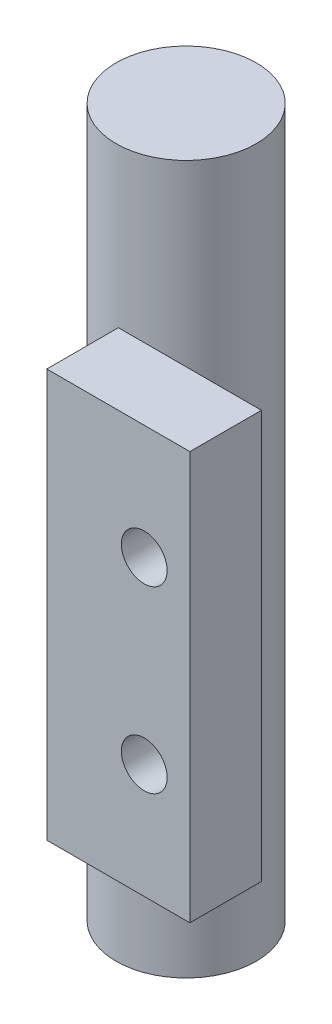
ISO-10303-21;
HEADER;
FILE_DESCRIPTION(('STEP AP214'),'2;1');
FILE_NAME('part.step','',(''),(''),'','','');
FILE_SCHEMA(('AUTOMOTIVE_DESIGN { 1 0 10303 214 1 1 1 1 }'));
ENDSEC;
DATA;
#1=APPLICATION_CONTEXT('core data for automotive mechanical design processes');
#2=APPLICATION_PROTOCOL_DEFINITION('international standard','automotive_design',2000,#1);
#3=PRODUCT_CONTEXT('',#1,'mechanical');
#4=PRODUCT('Part','Part','',(#3));
#5=PRODUCT_RELATED_PRODUCT_CATEGORY('part','',(#4));
#6=PRODUCT_DEFINITION_FORMATION('','',#4);
#7=PRODUCT_DEFINITION_CONTEXT('part definition',#1,'design');
#8=PRODUCT_DEFINITION('design','',#6,#7);
#9=PRODUCT_DEFINITION_SHAPE('','',#8);
#10=(LENGTH_UNIT() NAMED_UNIT(*) SI_UNIT(.MILLI.,.METRE.));
#11=(NAMED_UNIT(*) PLANE_ANGLE_UNIT() SI_UNIT($,.RADIAN.));
#12=(NAMED_UNIT(*) SI_UNIT($,.STERADIAN.) SOLID_ANGLE_UNIT());
#13=UNCERTAINTY_MEASURE_WITH_UNIT(LENGTH_MEASURE(1.E-05),#10,'distance_accuracy_value','');
#14=(GEOMETRIC_REPRESENTATION_CONTEXT(3) GLOBAL_UNCERTAINTY_ASSIGNED_CONTEXT((#13)) GLOBAL_UNIT_ASSIGNED_CONTEXT((#10,
#11,#12)) REPRESENTATION_CONTEXT('',''));
#15=CARTESIAN_POINT('',(0.,0.,0.));
#16=DIRECTION('',(0.,0.,1.));
#17=DIRECTION('',(1.,0.,0.));
#18=AXIS2_PLACEMENT_3D('',#15,#16,#17);
#19=CARTESIAN_POINT('',(-1.21410888509384,8.53481015756942,-5.9555332189598));
#20=DIRECTION('',(0.,-1.,0.));
#21=DIRECTION('',(1.,0.,0.));
#22=AXIS2_PLACEMENT_3D('',#19,#20,#21);
#23=CYLINDRICAL_SURFACE('',#22,4.9);
#24=CARTESIAN_POINT('',(-1.21410888509384,8.53481015756942,-5.9555332189598));
#25=DIRECTION('',(0.,-1.,0.));
#26=DIRECTION('',(1.,0.,0.));
#27=AXIS2_PLACEMENT_3D('',#24,#25,#26);
#28=CIRCLE('',#27,4.9);
#29=CARTESIAN_POINT('',(3.68589111490616,8.53481015756942,-5.9555332189598));
#30=VERTEX_POINT('',#29);
#31=EDGE_CURVE('E11',#30,#30,#28,.T.);
#32=ORIENTED_EDGE('',*,*,#31,.T.);
#33=EDGE_LOOP('',(#32));
#34=FACE_BOUND('',#33,.T.);
#35=CARTESIAN_POINT('',(-1.21410888509382,-40.9651898424306,-5.95553321895981));
#36=DIRECTION('',(0.,-1.,0.));
#37=DIRECTION('',(1.,0.,0.));
#38=AXIS2_PLACEMENT_3D('',#35,#36,#37);
#39=CIRCLE('',#38,4.9);
#40=CARTESIAN_POINT('',(3.68589111490618,-40.9651898424306,-5.95553321895981));
#41=VERTEX_POINT('',#40);
#42=EDGE_CURVE('E46',#41,#41,#39,.T.);
#43=ORIENTED_EDGE('',*,*,#42,.F.);
#44=EDGE_LOOP('',(#43));
#45=FACE_BOUND('',#44,.T.);
#46=ADVANCED_FACE('F43',(#34,#45),#23,.T.);
#47=CARTESIAN_POINT('',(-1.21410888509384,8.53481015756942,-5.9555332189598));
#48=DIRECTION('',(0.,-1.,0.));
#49=DIRECTION('',(1.,0.,0.));
#50=AXIS2_PLACEMENT_3D('',#47,#48,#49);
#51=PLANE('',#50);
#52=ORIENTED_EDGE('',*,*,#31,.F.);
#53=EDGE_LOOP('',(#52));
#54=FACE_BOUND('',#53,.T.);
#55=ADVANCED_FACE('F58',(#54),#51,.F.);
#56=CARTESIAN_POINT('',(-1.21410888509382,-40.9651898424306,-5.95553321895981));
#57=DIRECTION('',(0.,-1.,0.));
#58=DIRECTION('',(1.,0.,0.));
#59=AXIS2_PLACEMENT_3D('',#56,#57,#58);
#60=PLANE('',#59);
#61=ORIENTED_EDGE('',*,*,#42,.T.);
#62=EDGE_LOOP('',(#61));
#63=FACE_BOUND('',#62,.T.);
#64=ADVANCED_FACE('F55',(#63),#60,.T.);
#65=CLOSED_SHELL('',(#46,#55,#64));
#66=MANIFOLD_SOLID_BREP('B2',#65);
#67=CARTESIAN_POINT('',(10.,-1.47000000000001,5.));
#68=DIRECTION('',(-1.,0.,0.));
#69=DIRECTION('',(0.,-1.,0.));
#70=AXIS2_PLACEMENT_3D('',#67,#68,#69);
#71=PLANE('',#70);
#72=DIRECTION('',(0.,1.,0.));
#73=VECTOR('',#72,1.);
#74=CARTESIAN_POINT('',(10.,-1.47000000000001,0.));
#75=LINE('',#74,#73);
#76=CARTESIAN_POINT('',(10.,-30.,0.));
#77=VERTEX_POINT('',#76);
#78=CARTESIAN_POINT('',(10.,-1.47000000000001,0.));
#79=VERTEX_POINT('',#78);
#80=EDGE_CURVE('E147',#77,#79,#75,.T.);
#81=ORIENTED_EDGE('',*,*,#80,.T.);
#82=DIRECTION('',(0.,0.,-1.));
#83=VECTOR('',#82,1.);
#84=CARTESIAN_POINT('',(10.,-1.47000000000001,5.));
#85=LINE('',#84,#83);
#86=CARTESIAN_POINT('',(10.,-1.47000000000001,5.));
#87=VERTEX_POINT('',#86);
#88=EDGE_CURVE('E41',#87,#79,#85,.T.);
#89=ORIENTED_EDGE('',*,*,#88,.F.);
#90=DIRECTION('',(0.,1.,0.));
#91=VECTOR('',#90,1.);
#92=CARTESIAN_POINT('',(10.,-1.47000000000001,5.));
#93=LINE('',#92,#91);
#94=CARTESIAN_POINT('',(10.,-30.,5.));
#95=VERTEX_POINT('',#94);
#96=EDGE_CURVE('E135',#95,#87,#93,.T.);
#97=ORIENTED_EDGE('',*,*,#96,.F.);
#98=DIRECTION('',(0.,0.,-1.));
#99=VECTOR('',#98,1.);
#100=CARTESIAN_POINT('',(10.,-30.,5.));
#101=LINE('',#100,#99);
#102=EDGE_CURVE('E143',#95,#77,#101,.T.);
#103=ORIENTED_EDGE('',*,*,#102,.T.);
#104=EDGE_LOOP('',(#81,#89,#97,#103));
#105=FACE_BOUND('',#104,.T.);
#106=ADVANCED_FACE('F84',(#105),#71,.F.);
#107=CARTESIAN_POINT('',(10.,-1.47000000000001,5.));
#108=DIRECTION('',(0.,-1.,0.));
#109=DIRECTION('',(1.,0.,0.));
#110=AXIS2_PLACEMENT_3D('',#107,#108,#109);
#111=PLANE('',#110);
#112=DIRECTION('',(-1.,0.,0.));
#113=VECTOR('',#112,1.);
#114=CARTESIAN_POINT('',(10.,-1.47000000000001,0.));
#115=LINE('',#114,#113);
#116=CARTESIAN_POINT('',(0.,-1.47000000000001,0.));
#117=VERTEX_POINT('',#116);
#118=EDGE_CURVE('E139',#79,#117,#115,.T.);
#119=ORIENTED_EDGE('',*,*,#118,.T.);
#120=DIRECTION('',(0.,0.,-1.));
#121=VECTOR('',#120,1.);
#122=CARTESIAN_POINT('',(0.,-1.47000000000001,5.));
#123=LINE('',#122,#121);
#124=CARTESIAN_POINT('',(0.,-1.47000000000001,5.));
#125=VERTEX_POINT('',#124);
#126=EDGE_CURVE('E92',#125,#117,#123,.T.);
#127=ORIENTED_EDGE('',*,*,#126,.F.);
#128=DIRECTION('',(-1.,0.,0.));
#129=VECTOR('',#128,1.);
#130=CARTESIAN_POINT('',(10.,-1.47000000000001,5.));
#131=LINE('',#130,#129);
#132=EDGE_CURVE('E130',#87,#125,#131,.T.);
#133=ORIENTED_EDGE('',*,*,#132,.F.);
#134=ORIENTED_EDGE('',*,*,#88,.T.);
#135=EDGE_LOOP('',(#119,#127,#133,#134));
#136=FACE_BOUND('',#135,.T.);
#137=ADVANCED_FACE('F138',(#136),#111,.F.);
#138=CARTESIAN_POINT('',(0.,-1.47000000000001,5.));
#139=DIRECTION('',(1.,0.,0.));
#140=DIRECTION('',(0.,1.,0.));
#141=AXIS2_PLACEMENT_3D('',#138,#139,#140);
#142=PLANE('',#141);
#143=DIRECTION('',(0.,-1.,0.));
#144=VECTOR('',#143,1.);
#145=CARTESIAN_POINT('',(0.,-1.47000000000001,0.));
#146=LINE('',#145,#144);
#147=CARTESIAN_POINT('',(0.,-30.,0.));
#148=VERTEX_POINT('',#147);
#149=EDGE_CURVE('E117',#117,#148,#146,.T.);
#150=ORIENTED_EDGE('',*,*,#149,.T.);
#151=DIRECTION('',(0.,0.,-1.));
#152=VECTOR('',#151,1.);
#153=CARTESIAN_POINT('',(0.,-30.,5.));
#154=LINE('',#153,#152);
#155=CARTESIAN_POINT('',(0.,-30.,5.));
#156=VERTEX_POINT('',#155);
#157=EDGE_CURVE('E140',#156,#148,#154,.T.);
#158=ORIENTED_EDGE('',*,*,#157,.F.);
#159=DIRECTION('',(0.,-1.,0.));
#160=VECTOR('',#159,1.);
#161=CARTESIAN_POINT('',(0.,-1.47000000000001,5.));
#162=LINE('',#161,#160);
#163=EDGE_CURVE('E133',#125,#156,#162,.T.);
#164=ORIENTED_EDGE('',*,*,#163,.F.);
#165=ORIENTED_EDGE('',*,*,#126,.T.);
#166=EDGE_LOOP('',(#150,#158,#164,#165));
#167=FACE_BOUND('',#166,.T.);
#168=ADVANCED_FACE('F141',(#167),#142,.F.);
#169=CARTESIAN_POINT('',(10.,-30.,5.));
#170=DIRECTION('',(0.,1.,0.));
#171=DIRECTION('',(-1.,0.,0.));
#172=AXIS2_PLACEMENT_3D('',#169,#170,#171);
#173=PLANE('',#172);
#174=DIRECTION('',(1.,0.,0.));
#175=VECTOR('',#174,1.);
#176=CARTESIAN_POINT('',(10.,-30.,0.));
#177=LINE('',#176,#175);
#178=EDGE_CURVE('E123',#148,#77,#177,.T.);
#179=ORIENTED_EDGE('',*,*,#178,.T.);
#180=ORIENTED_EDGE('',*,*,#102,.F.);
#181=DIRECTION('',(1.,0.,0.));
#182=VECTOR('',#181,1.);
#183=CARTESIAN_POINT('',(10.,-30.,5.));
#184=LINE('',#183,#182);
#185=EDGE_CURVE('E100',#156,#95,#184,.T.);
#186=ORIENTED_EDGE('',*,*,#185,.F.);
#187=ORIENTED_EDGE('',*,*,#157,.T.);
#188=EDGE_LOOP('',(#179,#180,#186,#187));
#189=FACE_BOUND('',#188,.T.);
#190=ADVANCED_FACE('F155',(#189),#173,.F.);
#191=CARTESIAN_POINT('',(0.,0.,5.));
#192=DIRECTION('',(0.,0.,-1.));
#193=DIRECTION('',(-1.,0.,0.));
#194=AXIS2_PLACEMENT_3D('',#191,#192,#193);
#195=PLANE('',#194);
#196=CARTESIAN_POINT('',(6.81031037360218,-9.47000000000007,5.));
#197=DIRECTION('',(0.,0.,-1.));
#198=DIRECTION('',(-1.,0.,0.));
#199=AXIS2_PLACEMENT_3D('',#196,#197,#198);
#200=CIRCLE('',#199,1.6);
#201=CARTESIAN_POINT('',(5.21031037360218,-9.47000000000007,5.));
#202=VERTEX_POINT('',#201);
#203=EDGE_CURVE('E150',#202,#202,#200,.T.);
#204=ORIENTED_EDGE('',*,*,#203,.T.);
#205=EDGE_LOOP('',(#204));
#206=FACE_BOUND('',#205,.T.);
#207=CARTESIAN_POINT('',(6.81031037360219,-22.0000000000001,5.));
#208=DIRECTION('',(0.,0.,-1.));
#209=DIRECTION('',(-1.,0.,0.));
#210=AXIS2_PLACEMENT_3D('',#207,#208,#209);
#211=CIRCLE('',#210,1.6);
#212=CARTESIAN_POINT('',(5.21031037360218,-22.0000000000001,5.));
#213=VERTEX_POINT('',#212);
#214=EDGE_CURVE('E163',#213,#213,#211,.T.);
#215=ORIENTED_EDGE('',*,*,#214,.T.);
#216=EDGE_LOOP('',(#215));
#217=FACE_BOUND('',#216,.T.);
#218=ORIENTED_EDGE('',*,*,#96,.T.);
#219=ORIENTED_EDGE('',*,*,#132,.T.);
#220=ORIENTED_EDGE('',*,*,#163,.T.);
#221=ORIENTED_EDGE('',*,*,#185,.T.);
#222=EDGE_LOOP('',(#218,#219,#220,#221));
#223=FACE_BOUND('',#222,.T.);
#224=ADVANCED_FACE('F131',(#206,#217,#223),#195,.F.);
#225=CARTESIAN_POINT('',(0.,0.,0.));
#226=DIRECTION('',(0.,0.,-1.));
#227=DIRECTION('',(-1.,0.,0.));
#228=AXIS2_PLACEMENT_3D('',#225,#226,#227);
#229=PLANE('',#228);
#230=CARTESIAN_POINT('',(6.81031037360218,-9.47000000000007,0.));
#231=DIRECTION('',(0.,0.,-1.));
#232=DIRECTION('',(-1.,0.,0.));
#233=AXIS2_PLACEMENT_3D('',#230,#231,#232);
#234=CIRCLE('',#233,1.6);
#235=CARTESIAN_POINT('',(5.21031037360218,-9.47000000000007,0.));
#236=VERTEX_POINT('',#235);
#237=EDGE_CURVE('E166',#236,#236,#234,.T.);
#238=ORIENTED_EDGE('',*,*,#237,.F.);
#239=EDGE_LOOP('',(#238));
#240=FACE_BOUND('',#239,.T.);
#241=CARTESIAN_POINT('',(6.81031037360219,-22.0000000000001,0.));
#242=DIRECTION('',(0.,0.,-1.));
#243=DIRECTION('',(-1.,0.,0.));
#244=AXIS2_PLACEMENT_3D('',#241,#242,#243);
#245=CIRCLE('',#244,1.6);
#246=CARTESIAN_POINT('',(5.21031037360218,-22.0000000000001,0.));
#247=VERTEX_POINT('',#246);
#248=EDGE_CURVE('E167',#247,#247,#245,.T.);
#249=ORIENTED_EDGE('',*,*,#248,.F.);
#250=EDGE_LOOP('',(#249));
#251=FACE_BOUND('',#250,.T.);
#252=ORIENTED_EDGE('',*,*,#80,.F.);
#253=ORIENTED_EDGE('',*,*,#178,.F.);
#254=ORIENTED_EDGE('',*,*,#149,.F.);
#255=ORIENTED_EDGE('',*,*,#118,.F.);
#256=EDGE_LOOP('',(#252,#253,#254,#255));
#257=FACE_BOUND('',#256,.T.);
#258=ADVANCED_FACE('F158',(#240,#251,#257),#229,.T.);
#259=CARTESIAN_POINT('',(6.81031037360219,-22.0000000000001,43.));
#260=DIRECTION('',(0.,0.,-1.));
#261=DIRECTION('',(-1.,0.,0.));
#262=AXIS2_PLACEMENT_3D('',#259,#260,#261);
#263=CYLINDRICAL_SURFACE('',#262,1.6);
#264=ORIENTED_EDGE('',*,*,#248,.T.);
#265=EDGE_LOOP('',(#264));
#266=FACE_BOUND('',#265,.T.);
#267=ORIENTED_EDGE('',*,*,#214,.F.);
#268=EDGE_LOOP('',(#267));
#269=FACE_BOUND('',#268,.T.);
#270=ADVANCED_FACE('F178',(#266,#269),#263,.F.);
#271=CARTESIAN_POINT('',(6.81031037360218,-9.47000000000007,43.));
#272=DIRECTION('',(0.,0.,-1.));
#273=DIRECTION('',(-1.,0.,0.));
#274=AXIS2_PLACEMENT_3D('',#271,#272,#273);
#275=CYLINDRICAL_SURFACE('',#274,1.6);
#276=ORIENTED_EDGE('',*,*,#237,.T.);
#277=EDGE_LOOP('',(#276));
#278=FACE_BOUND('',#277,.T.);
#279=ORIENTED_EDGE('',*,*,#203,.F.);
#280=EDGE_LOOP('',(#279));
#281=FACE_BOUND('',#280,.T.);
#282=ADVANCED_FACE('F173',(#278,#281),#275,.F.);
#283=CLOSED_SHELL('',(#106,#137,#168,#190,#224,#258,#270,#282));
#284=MANIFOLD_SOLID_BREP('B6',#283);
#285=ADVANCED_BREP_SHAPE_REPRESENTATION('',(#18,#66,#284),#14);
#286=SHAPE_DEFINITION_REPRESENTATION(#9,#285);
ENDSEC;
END-ISO-10303-21;
